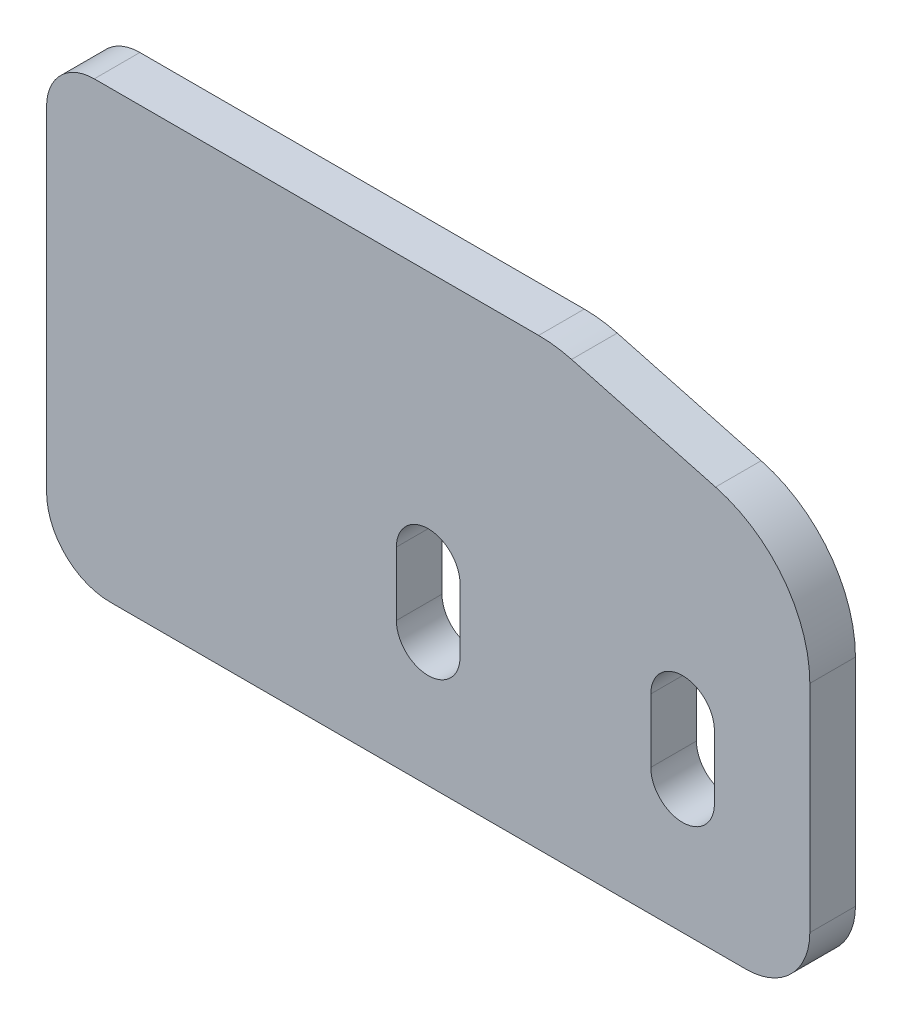
ISO-10303-21;
HEADER;
FILE_DESCRIPTION(('STEP AP214'),'2;1');
FILE_NAME('part.step','',(''),(''),'','','');
FILE_SCHEMA(('AUTOMOTIVE_DESIGN { 1 0 10303 214 1 1 1 1 }'));
ENDSEC;
DATA;
#1=APPLICATION_CONTEXT('core data for automotive mechanical design processes');
#2=APPLICATION_PROTOCOL_DEFINITION('international standard','automotive_design',2000,#1);
#3=PRODUCT_CONTEXT('',#1,'mechanical');
#4=PRODUCT('Part','Part','',(#3));
#5=PRODUCT_RELATED_PRODUCT_CATEGORY('part','',(#4));
#6=PRODUCT_DEFINITION_FORMATION('','',#4);
#7=PRODUCT_DEFINITION_CONTEXT('part definition',#1,'design');
#8=PRODUCT_DEFINITION('design','',#6,#7);
#9=PRODUCT_DEFINITION_SHAPE('','',#8);
#10=(LENGTH_UNIT() NAMED_UNIT(*) SI_UNIT(.MILLI.,.METRE.));
#11=(NAMED_UNIT(*) PLANE_ANGLE_UNIT() SI_UNIT($,.RADIAN.));
#12=(NAMED_UNIT(*) SI_UNIT($,.STERADIAN.) SOLID_ANGLE_UNIT());
#13=UNCERTAINTY_MEASURE_WITH_UNIT(LENGTH_MEASURE(1.E-05),#10,'distance_accuracy_value','');
#14=(GEOMETRIC_REPRESENTATION_CONTEXT(3) GLOBAL_UNCERTAINTY_ASSIGNED_CONTEXT((#13)) GLOBAL_UNIT_ASSIGNED_CONTEXT((#10,
#11,#12)) REPRESENTATION_CONTEXT('',''));
#15=CARTESIAN_POINT('',(0.,0.,0.));
#16=DIRECTION('',(0.,0.,1.));
#17=DIRECTION('',(1.,0.,0.));
#18=AXIS2_PLACEMENT_3D('',#15,#16,#17);
#19=CARTESIAN_POINT('',(-38.1,-22.225,4.55422));
#20=DIRECTION('',(0.,0.,-1.));
#21=DIRECTION('',(-1.,0.,0.));
#22=AXIS2_PLACEMENT_3D('',#19,#20,#21);
#23=PLANE('',#22);
#24=DIRECTION('',(0.,1.,0.));
#25=VECTOR('',#24,1.);
#26=CARTESIAN_POINT('',(28.575,-9.52500000000001,4.55422));
#27=LINE('',#26,#25);
#28=CARTESIAN_POINT('',(28.575,-9.52500000000001,4.55422));
#29=VERTEX_POINT('',#28);
#30=CARTESIAN_POINT('',(28.575,-3.17500000000001,4.55422));
#31=VERTEX_POINT('',#30);
#32=EDGE_CURVE('E206',#29,#31,#27,.T.);
#33=ORIENTED_EDGE('',*,*,#32,.F.);
#34=CARTESIAN_POINT('',(25.4,-9.52500000000001,4.55422));
#35=DIRECTION('',(0.,0.,1.));
#36=DIRECTION('',(1.,0.,0.));
#37=AXIS2_PLACEMENT_3D('',#34,#35,#36);
#38=CIRCLE('',#37,3.175);
#39=CARTESIAN_POINT('',(22.225,-9.52500000000001,4.55422));
#40=VERTEX_POINT('',#39);
#41=EDGE_CURVE('E218',#40,#29,#38,.T.);
#42=ORIENTED_EDGE('',*,*,#41,.F.);
#43=DIRECTION('',(0.,-1.,0.));
#44=VECTOR('',#43,1.);
#45=CARTESIAN_POINT('',(22.225,-9.52500000000001,4.55422));
#46=LINE('',#45,#44);
#47=CARTESIAN_POINT('',(22.225,-3.17500000000001,4.55422));
#48=VERTEX_POINT('',#47);
#49=EDGE_CURVE('E59',#48,#40,#46,.T.);
#50=ORIENTED_EDGE('',*,*,#49,.F.);
#51=CARTESIAN_POINT('',(25.4,-3.17500000000001,4.55422));
#52=DIRECTION('',(0.,0.,1.));
#53=DIRECTION('',(1.,0.,0.));
#54=AXIS2_PLACEMENT_3D('',#51,#52,#53);
#55=CIRCLE('',#54,3.175);
#56=EDGE_CURVE('E198',#31,#48,#55,.T.);
#57=ORIENTED_EDGE('',*,*,#56,.F.);
#58=EDGE_LOOP('',(#33,#42,#50,#57));
#59=FACE_BOUND('',#58,.T.);
#60=DIRECTION('',(1.,0.,0.));
#61=VECTOR('',#60,1.);
#62=CARTESIAN_POINT('',(38.1,-22.225,4.55422));
#63=LINE('',#62,#61);
#64=CARTESIAN_POINT('',(-31.75,-22.225,4.55422));
#65=VERTEX_POINT('',#64);
#66=CARTESIAN_POINT('',(31.75,-22.225,4.55422));
#67=VERTEX_POINT('',#66);
#68=EDGE_CURVE('E240',#65,#67,#63,.T.);
#69=ORIENTED_EDGE('',*,*,#68,.T.);
#70=CARTESIAN_POINT('',(31.75,-15.875,4.55422));
#71=DIRECTION('',(0.,0.,-1.));
#72=DIRECTION('',(-1.,0.,0.));
#73=AXIS2_PLACEMENT_3D('',#70,#71,#72);
#74=CIRCLE('',#73,6.35);
#75=CARTESIAN_POINT('',(38.1,-15.875,4.55422));
#76=VERTEX_POINT('',#75);
#77=EDGE_CURVE('E44',#67,#76,#74,.F.);
#78=ORIENTED_EDGE('',*,*,#77,.T.);
#79=DIRECTION('',(0.,1.,0.));
#80=VECTOR('',#79,1.);
#81=CARTESIAN_POINT('',(38.1,22.225,4.55422));
#82=LINE('',#81,#80);
#83=CARTESIAN_POINT('',(38.1,5.6740377649168,4.55422));
#84=VERTEX_POINT('',#83);
#85=EDGE_CURVE('E244',#76,#84,#82,.T.);
#86=ORIENTED_EDGE('',*,*,#85,.T.);
#87=CARTESIAN_POINT('',(25.4,5.67403776491679,4.55422));
#88=DIRECTION('',(0.,0.,-1.));
#89=DIRECTION('',(-1.,0.,0.));
#90=AXIS2_PLACEMENT_3D('',#87,#88,#89);
#91=CIRCLE('',#90,12.7);
#92=CARTESIAN_POINT('',(28.687001872802,17.941295758788,4.55422));
#93=VERTEX_POINT('',#92);
#94=EDGE_CURVE('E282',#84,#93,#91,.F.);
#95=ORIENTED_EDGE('',*,*,#94,.T.);
#96=DIRECTION('',(0.96592582628907,-0.258819045102515,0.));
#97=VECTOR('',#96,1.);
#98=CARTESIAN_POINT('',(12.7,22.225,4.55422));
#99=LINE('',#98,#97);
#100=CARTESIAN_POINT('',(14.3150151534421,21.7922579938712,4.55422));
#101=VERTEX_POINT('',#100);
#102=EDGE_CURVE('E228',#101,#93,#99,.T.);
#103=ORIENTED_EDGE('',*,*,#102,.F.);
#104=CARTESIAN_POINT('',(11.0280132806401,9.525,4.55422));
#105=DIRECTION('',(0.,0.,-1.));
#106=DIRECTION('',(-1.,0.,0.));
#107=AXIS2_PLACEMENT_3D('',#104,#105,#106);
#108=CIRCLE('',#107,12.7);
#109=CARTESIAN_POINT('',(11.0280132806401,22.225,4.55422));
#110=VERTEX_POINT('',#109);
#111=EDGE_CURVE('E280',#101,#110,#108,.F.);
#112=ORIENTED_EDGE('',*,*,#111,.T.);
#113=DIRECTION('',(-1.,0.,0.));
#114=VECTOR('',#113,1.);
#115=CARTESIAN_POINT('',(38.1,22.225,4.55422));
#116=LINE('',#115,#114);
#117=CARTESIAN_POINT('',(-33.3375,22.225,4.55422));
#118=VERTEX_POINT('',#117);
#119=EDGE_CURVE('E246',#110,#118,#116,.T.);
#120=ORIENTED_EDGE('',*,*,#119,.T.);
#121=CARTESIAN_POINT('',(-33.3375,17.4625,4.55422));
#122=DIRECTION('',(0.,0.,-1.));
#123=DIRECTION('',(-1.,0.,0.));
#124=AXIS2_PLACEMENT_3D('',#121,#122,#123);
#125=CIRCLE('',#124,4.7625);
#126=CARTESIAN_POINT('',(-38.1,17.4625,4.55422));
#127=VERTEX_POINT('',#126);
#128=EDGE_CURVE('E265',#118,#127,#125,.F.);
#129=ORIENTED_EDGE('',*,*,#128,.T.);
#130=DIRECTION('',(0.,-1.,0.));
#131=VECTOR('',#130,1.);
#132=CARTESIAN_POINT('',(-38.1,22.225,4.55422));
#133=LINE('',#132,#131);
#134=CARTESIAN_POINT('',(-38.1,-15.875,4.55422));
#135=VERTEX_POINT('',#134);
#136=EDGE_CURVE('E237',#127,#135,#133,.T.);
#137=ORIENTED_EDGE('',*,*,#136,.T.);
#138=CARTESIAN_POINT('',(-31.75,-15.875,4.55422));
#139=DIRECTION('',(0.,0.,-1.));
#140=DIRECTION('',(-1.,0.,0.));
#141=AXIS2_PLACEMENT_3D('',#138,#139,#140);
#142=CIRCLE('',#141,6.35);
#143=EDGE_CURVE('E299',#135,#65,#142,.F.);
#144=ORIENTED_EDGE('',*,*,#143,.T.);
#145=EDGE_LOOP('',(#69,#78,#86,#95,#103,#112,#120,#129,#137,#144));
#146=FACE_BOUND('',#145,.T.);
#147=DIRECTION('',(0.,1.,0.));
#148=VECTOR('',#147,1.);
#149=CARTESIAN_POINT('',(3.17499999999998,-9.52500000000001,4.55422));
#150=LINE('',#149,#148);
#151=CARTESIAN_POINT('',(3.17500000000002,-9.52500000000001,4.55422));
#152=VERTEX_POINT('',#151);
#153=CARTESIAN_POINT('',(3.17499999999998,-3.17500000000001,4.55422));
#154=VERTEX_POINT('',#153);
#155=EDGE_CURVE('E187',#152,#154,#150,.T.);
#156=ORIENTED_EDGE('',*,*,#155,.F.);
#157=CARTESIAN_POINT('',(0.,-9.52500000000001,4.55422));
#158=DIRECTION('',(0.,0.,1.));
#159=DIRECTION('',(1.,0.,0.));
#160=AXIS2_PLACEMENT_3D('',#157,#158,#159);
#161=CIRCLE('',#160,3.175);
#162=CARTESIAN_POINT('',(-3.17499999999998,-9.52500000000001,4.55422));
#163=VERTEX_POINT('',#162);
#164=EDGE_CURVE('E223',#163,#152,#161,.T.);
#165=ORIENTED_EDGE('',*,*,#164,.F.);
#166=DIRECTION('',(0.,-1.,0.));
#167=VECTOR('',#166,1.);
#168=CARTESIAN_POINT('',(-3.17499999999998,-9.52500000000001,4.55422));
#169=LINE('',#168,#167);
#170=CARTESIAN_POINT('',(-3.17499999999998,-3.17500000000001,4.55422));
#171=VERTEX_POINT('',#170);
#172=EDGE_CURVE('E51',#171,#163,#169,.T.);
#173=ORIENTED_EDGE('',*,*,#172,.F.);
#174=CARTESIAN_POINT('',(0.,-3.17500000000001,4.55422));
#175=DIRECTION('',(0.,0.,1.));
#176=DIRECTION('',(1.,0.,0.));
#177=AXIS2_PLACEMENT_3D('',#174,#175,#176);
#178=CIRCLE('',#177,3.17499999999998);
#179=EDGE_CURVE('E170',#154,#171,#178,.T.);
#180=ORIENTED_EDGE('',*,*,#179,.F.);
#181=EDGE_LOOP('',(#156,#165,#173,#180));
#182=FACE_BOUND('',#181,.T.);
#183=ADVANCED_FACE('F36',(#59,#146,#182),#23,.F.);
#184=CARTESIAN_POINT('',(-38.1,-22.225,0.));
#185=DIRECTION('',(0.,0.,-1.));
#186=DIRECTION('',(-1.,0.,0.));
#187=AXIS2_PLACEMENT_3D('',#184,#185,#186);
#188=PLANE('',#187);
#189=DIRECTION('',(0.,1.,0.));
#190=VECTOR('',#189,1.);
#191=CARTESIAN_POINT('',(38.1,22.225,0.));
#192=LINE('',#191,#190);
#193=CARTESIAN_POINT('',(38.1,-15.875,0.));
#194=VERTEX_POINT('',#193);
#195=CARTESIAN_POINT('',(38.1,5.6740377649168,0.));
#196=VERTEX_POINT('',#195);
#197=EDGE_CURVE('E254',#194,#196,#192,.T.);
#198=ORIENTED_EDGE('',*,*,#197,.F.);
#199=CARTESIAN_POINT('',(31.75,-15.875,0.));
#200=DIRECTION('',(0.,0.,-1.));
#201=DIRECTION('',(-1.,0.,0.));
#202=AXIS2_PLACEMENT_3D('',#199,#200,#201);
#203=CIRCLE('',#202,6.35);
#204=CARTESIAN_POINT('',(31.75,-22.225,0.));
#205=VERTEX_POINT('',#204);
#206=EDGE_CURVE('E292',#194,#205,#203,.T.);
#207=ORIENTED_EDGE('',*,*,#206,.T.);
#208=DIRECTION('',(1.,0.,0.));
#209=VECTOR('',#208,1.);
#210=CARTESIAN_POINT('',(38.1,-22.225,0.));
#211=LINE('',#210,#209);
#212=CARTESIAN_POINT('',(-31.75,-22.225,0.));
#213=VERTEX_POINT('',#212);
#214=EDGE_CURVE('E251',#213,#205,#211,.T.);
#215=ORIENTED_EDGE('',*,*,#214,.F.);
#216=CARTESIAN_POINT('',(-31.75,-15.875,0.));
#217=DIRECTION('',(0.,0.,-1.));
#218=DIRECTION('',(-1.,0.,0.));
#219=AXIS2_PLACEMENT_3D('',#216,#217,#218);
#220=CIRCLE('',#219,6.35);
#221=CARTESIAN_POINT('',(-38.1,-15.875,0.));
#222=VERTEX_POINT('',#221);
#223=EDGE_CURVE('E290',#213,#222,#220,.T.);
#224=ORIENTED_EDGE('',*,*,#223,.T.);
#225=DIRECTION('',(0.,-1.,0.));
#226=VECTOR('',#225,1.);
#227=CARTESIAN_POINT('',(-38.1,22.225,0.));
#228=LINE('',#227,#226);
#229=CARTESIAN_POINT('',(-38.1,17.4625,0.));
#230=VERTEX_POINT('',#229);
#231=EDGE_CURVE('E234',#230,#222,#228,.T.);
#232=ORIENTED_EDGE('',*,*,#231,.F.);
#233=CARTESIAN_POINT('',(-33.3375,17.4625,0.));
#234=DIRECTION('',(0.,0.,-1.));
#235=DIRECTION('',(-1.,0.,0.));
#236=AXIS2_PLACEMENT_3D('',#233,#234,#235);
#237=CIRCLE('',#236,4.7625);
#238=CARTESIAN_POINT('',(-33.3375,22.225,0.));
#239=VERTEX_POINT('',#238);
#240=EDGE_CURVE('E259',#230,#239,#237,.T.);
#241=ORIENTED_EDGE('',*,*,#240,.T.);
#242=DIRECTION('',(-1.,0.,0.));
#243=VECTOR('',#242,1.);
#244=CARTESIAN_POINT('',(38.1,22.225,0.));
#245=LINE('',#244,#243);
#246=CARTESIAN_POINT('',(11.0280132806401,22.225,0.));
#247=VERTEX_POINT('',#246);
#248=EDGE_CURVE('E241',#247,#239,#245,.T.);
#249=ORIENTED_EDGE('',*,*,#248,.F.);
#250=CARTESIAN_POINT('',(11.0280132806401,9.525,0.));
#251=DIRECTION('',(0.,0.,-1.));
#252=DIRECTION('',(-1.,0.,0.));
#253=AXIS2_PLACEMENT_3D('',#250,#251,#252);
#254=CIRCLE('',#253,12.7);
#255=CARTESIAN_POINT('',(14.3150151534421,21.7922579938712,0.));
#256=VERTEX_POINT('',#255);
#257=EDGE_CURVE('E272',#247,#256,#254,.T.);
#258=ORIENTED_EDGE('',*,*,#257,.T.);
#259=DIRECTION('',(0.96592582628907,-0.258819045102515,0.));
#260=VECTOR('',#259,1.);
#261=CARTESIAN_POINT('',(12.7,22.225,0.));
#262=LINE('',#261,#260);
#263=CARTESIAN_POINT('',(28.687001872802,17.941295758788,0.));
#264=VERTEX_POINT('',#263);
#265=EDGE_CURVE('E231',#256,#264,#262,.T.);
#266=ORIENTED_EDGE('',*,*,#265,.T.);
#267=CARTESIAN_POINT('',(25.4,5.67403776491679,0.));
#268=DIRECTION('',(0.,0.,-1.));
#269=DIRECTION('',(-1.,0.,0.));
#270=AXIS2_PLACEMENT_3D('',#267,#268,#269);
#271=CIRCLE('',#270,12.7);
#272=EDGE_CURVE('E274',#264,#196,#271,.T.);
#273=ORIENTED_EDGE('',*,*,#272,.T.);
#274=EDGE_LOOP('',(#198,#207,#215,#224,#232,#241,#249,#258,#266,#273));
#275=FACE_BOUND('',#274,.T.);
#276=CARTESIAN_POINT('',(25.4,-9.52500000000001,0.));
#277=DIRECTION('',(0.,0.,1.));
#278=DIRECTION('',(1.,0.,0.));
#279=AXIS2_PLACEMENT_3D('',#276,#277,#278);
#280=CIRCLE('',#279,3.175);
#281=CARTESIAN_POINT('',(22.225,-9.52500000000001,0.));
#282=VERTEX_POINT('',#281);
#283=CARTESIAN_POINT('',(28.575,-9.52500000000001,0.));
#284=VERTEX_POINT('',#283);
#285=EDGE_CURVE('E220',#282,#284,#280,.T.);
#286=ORIENTED_EDGE('',*,*,#285,.T.);
#287=DIRECTION('',(0.,1.,0.));
#288=VECTOR('',#287,1.);
#289=CARTESIAN_POINT('',(28.575,-22.225,0.));
#290=LINE('',#289,#288);
#291=CARTESIAN_POINT('',(28.575,-3.17500000000001,0.));
#292=VERTEX_POINT('',#291);
#293=EDGE_CURVE('E197',#284,#292,#290,.T.);
#294=ORIENTED_EDGE('',*,*,#293,.T.);
#295=CARTESIAN_POINT('',(25.4,-3.17500000000001,0.));
#296=DIRECTION('',(0.,0.,1.));
#297=DIRECTION('',(1.,0.,0.));
#298=AXIS2_PLACEMENT_3D('',#295,#296,#297);
#299=CIRCLE('',#298,3.175);
#300=CARTESIAN_POINT('',(22.225,-3.17500000000001,0.));
#301=VERTEX_POINT('',#300);
#302=EDGE_CURVE('E199',#292,#301,#299,.T.);
#303=ORIENTED_EDGE('',*,*,#302,.T.);
#304=DIRECTION('',(0.,1.,0.));
#305=VECTOR('',#304,1.);
#306=CARTESIAN_POINT('',(22.225,-22.225,0.));
#307=LINE('',#306,#305);
#308=EDGE_CURVE('E194',#301,#282,#307,.F.);
#309=ORIENTED_EDGE('',*,*,#308,.T.);
#310=EDGE_LOOP('',(#286,#294,#303,#309));
#311=FACE_BOUND('',#310,.T.);
#312=CARTESIAN_POINT('',(0.,-9.52500000000001,0.));
#313=DIRECTION('',(0.,0.,1.));
#314=DIRECTION('',(1.,0.,0.));
#315=AXIS2_PLACEMENT_3D('',#312,#313,#314);
#316=CIRCLE('',#315,3.175);
#317=CARTESIAN_POINT('',(-3.17499999999998,-9.52500000000001,0.));
#318=VERTEX_POINT('',#317);
#319=CARTESIAN_POINT('',(3.17500000000002,-9.52500000000001,0.));
#320=VERTEX_POINT('',#319);
#321=EDGE_CURVE('E226',#318,#320,#316,.T.);
#322=ORIENTED_EDGE('',*,*,#321,.T.);
#323=DIRECTION('',(0.,1.,0.));
#324=VECTOR('',#323,1.);
#325=CARTESIAN_POINT('',(3.17500000000002,-22.225,0.));
#326=LINE('',#325,#324);
#327=CARTESIAN_POINT('',(3.17499999999998,-3.17500000000001,0.));
#328=VERTEX_POINT('',#327);
#329=EDGE_CURVE('E169',#320,#328,#326,.T.);
#330=ORIENTED_EDGE('',*,*,#329,.T.);
#331=CARTESIAN_POINT('',(0.,-3.17500000000001,0.));
#332=DIRECTION('',(0.,0.,1.));
#333=DIRECTION('',(1.,0.,0.));
#334=AXIS2_PLACEMENT_3D('',#331,#332,#333);
#335=CIRCLE('',#334,3.17499999999998);
#336=CARTESIAN_POINT('',(-3.17499999999998,-3.17500000000001,0.));
#337=VERTEX_POINT('',#336);
#338=EDGE_CURVE('E175',#328,#337,#335,.T.);
#339=ORIENTED_EDGE('',*,*,#338,.T.);
#340=DIRECTION('',(0.,1.,0.));
#341=VECTOR('',#340,1.);
#342=CARTESIAN_POINT('',(-3.17499999999998,-22.225,0.));
#343=LINE('',#342,#341);
#344=EDGE_CURVE('E160',#337,#318,#343,.F.);
#345=ORIENTED_EDGE('',*,*,#344,.T.);
#346=EDGE_LOOP('',(#322,#330,#339,#345));
#347=FACE_BOUND('',#346,.T.);
#348=ADVANCED_FACE('F181',(#275,#311,#347),#188,.T.);
#349=CARTESIAN_POINT('',(38.1,22.225,4.55422));
#350=DIRECTION('',(-1.,0.,0.));
#351=DIRECTION('',(0.,-1.,0.));
#352=AXIS2_PLACEMENT_3D('',#349,#350,#351);
#353=PLANE('',#352);
#354=ORIENTED_EDGE('',*,*,#85,.F.);
#355=DIRECTION('',(0.,0.,-1.));
#356=VECTOR('',#355,1.);
#357=CARTESIAN_POINT('',(38.1,-15.875,4.55422));
#358=LINE('',#357,#356);
#359=EDGE_CURVE('E287',#76,#194,#358,.T.);
#360=ORIENTED_EDGE('',*,*,#359,.T.);
#361=ORIENTED_EDGE('',*,*,#197,.T.);
#362=DIRECTION('',(0.,0.,-1.));
#363=VECTOR('',#362,1.);
#364=CARTESIAN_POINT('',(38.1,5.6740377649168,4.55422));
#365=LINE('',#364,#363);
#366=EDGE_CURVE('E277',#196,#84,#365,.F.);
#367=ORIENTED_EDGE('',*,*,#366,.T.);
#368=EDGE_LOOP('',(#354,#360,#361,#367));
#369=FACE_BOUND('',#368,.T.);
#370=ADVANCED_FACE('F309',(#369),#353,.F.);
#371=CARTESIAN_POINT('',(38.1,22.225,4.55422));
#372=DIRECTION('',(0.,-1.,0.));
#373=DIRECTION('',(1.,0.,0.));
#374=AXIS2_PLACEMENT_3D('',#371,#372,#373);
#375=PLANE('',#374);
#376=ORIENTED_EDGE('',*,*,#119,.F.);
#377=DIRECTION('',(0.,0.,-1.));
#378=VECTOR('',#377,1.);
#379=CARTESIAN_POINT('',(11.0280132806401,22.225,0.));
#380=LINE('',#379,#378);
#381=EDGE_CURVE('E284',#110,#247,#380,.T.);
#382=ORIENTED_EDGE('',*,*,#381,.T.);
#383=ORIENTED_EDGE('',*,*,#248,.T.);
#384=DIRECTION('',(0.,0.,-1.));
#385=VECTOR('',#384,1.);
#386=CARTESIAN_POINT('',(-33.3375,22.225,4.55422));
#387=LINE('',#386,#385);
#388=EDGE_CURVE('E262',#239,#118,#387,.F.);
#389=ORIENTED_EDGE('',*,*,#388,.T.);
#390=EDGE_LOOP('',(#376,#382,#383,#389));
#391=FACE_BOUND('',#390,.T.);
#392=ADVANCED_FACE('F336',(#391),#375,.F.);
#393=CARTESIAN_POINT('',(-38.1,22.225,4.55422));
#394=DIRECTION('',(1.,0.,0.));
#395=DIRECTION('',(0.,1.,0.));
#396=AXIS2_PLACEMENT_3D('',#393,#394,#395);
#397=PLANE('',#396);
#398=ORIENTED_EDGE('',*,*,#231,.T.);
#399=DIRECTION('',(0.,0.,-1.));
#400=VECTOR('',#399,1.);
#401=CARTESIAN_POINT('',(-38.1,-15.875,4.55422));
#402=LINE('',#401,#400);
#403=EDGE_CURVE('E11',#222,#135,#402,.F.);
#404=ORIENTED_EDGE('',*,*,#403,.T.);
#405=ORIENTED_EDGE('',*,*,#136,.F.);
#406=DIRECTION('',(0.,0.,-1.));
#407=VECTOR('',#406,1.);
#408=CARTESIAN_POINT('',(-38.1,17.4625,4.55422));
#409=LINE('',#408,#407);
#410=EDGE_CURVE('E248',#127,#230,#409,.T.);
#411=ORIENTED_EDGE('',*,*,#410,.T.);
#412=EDGE_LOOP('',(#398,#404,#405,#411));
#413=FACE_BOUND('',#412,.T.);
#414=ADVANCED_FACE('F325',(#413),#397,.F.);
#415=CARTESIAN_POINT('',(38.1,-22.225,4.55422));
#416=DIRECTION('',(0.,1.,0.));
#417=DIRECTION('',(-1.,0.,0.));
#418=AXIS2_PLACEMENT_3D('',#415,#416,#417);
#419=PLANE('',#418);
#420=ORIENTED_EDGE('',*,*,#214,.T.);
#421=DIRECTION('',(0.,0.,-1.));
#422=VECTOR('',#421,1.);
#423=CARTESIAN_POINT('',(31.75,-22.225,4.55422));
#424=LINE('',#423,#422);
#425=EDGE_CURVE('E297',#205,#67,#424,.F.);
#426=ORIENTED_EDGE('',*,*,#425,.T.);
#427=ORIENTED_EDGE('',*,*,#68,.F.);
#428=DIRECTION('',(0.,0.,-1.));
#429=VECTOR('',#428,1.);
#430=CARTESIAN_POINT('',(-31.75,-22.225,4.55422));
#431=LINE('',#430,#429);
#432=EDGE_CURVE('E294',#65,#213,#431,.T.);
#433=ORIENTED_EDGE('',*,*,#432,.T.);
#434=EDGE_LOOP('',(#420,#426,#427,#433));
#435=FACE_BOUND('',#434,.T.);
#436=ADVANCED_FACE('F318',(#435),#419,.F.);
#437=CARTESIAN_POINT('',(12.7,22.225,4.55422));
#438=DIRECTION('',(0.258819045102515,0.96592582628907,0.));
#439=DIRECTION('',(0.96592582628907,-0.258819045102515,0.));
#440=AXIS2_PLACEMENT_3D('',#437,#438,#439);
#441=PLANE('',#440);
#442=ORIENTED_EDGE('',*,*,#102,.T.);
#443=DIRECTION('',(0.,0.,-1.));
#444=VECTOR('',#443,1.);
#445=CARTESIAN_POINT('',(28.687001872802,17.941295758788,0.));
#446=LINE('',#445,#444);
#447=EDGE_CURVE('E269',#93,#264,#446,.T.);
#448=ORIENTED_EDGE('',*,*,#447,.T.);
#449=ORIENTED_EDGE('',*,*,#265,.F.);
#450=DIRECTION('',(0.,0.,-1.));
#451=VECTOR('',#450,1.);
#452=CARTESIAN_POINT('',(14.3150151534421,21.7922579938712,4.55422));
#453=LINE('',#452,#451);
#454=EDGE_CURVE('E267',#256,#101,#453,.F.);
#455=ORIENTED_EDGE('',*,*,#454,.T.);
#456=EDGE_LOOP('',(#442,#448,#449,#455));
#457=FACE_BOUND('',#456,.T.);
#458=ADVANCED_FACE('F344',(#457),#441,.T.);
#459=CARTESIAN_POINT('',(-33.3375,17.4625,4.55422));
#460=DIRECTION('',(0.,0.,-1.));
#461=DIRECTION('',(-1.,0.,0.));
#462=AXIS2_PLACEMENT_3D('',#459,#460,#461);
#463=CYLINDRICAL_SURFACE('',#462,4.7625);
#464=ORIENTED_EDGE('',*,*,#128,.F.);
#465=ORIENTED_EDGE('',*,*,#388,.F.);
#466=ORIENTED_EDGE('',*,*,#240,.F.);
#467=ORIENTED_EDGE('',*,*,#410,.F.);
#468=EDGE_LOOP('',(#464,#465,#466,#467));
#469=FACE_BOUND('',#468,.T.);
#470=ADVANCED_FACE('F330',(#469),#463,.T.);
#471=CARTESIAN_POINT('',(25.4,5.67403776491679,4.55422));
#472=DIRECTION('',(0.,0.,1.));
#473=DIRECTION('',(1.,0.,0.));
#474=AXIS2_PLACEMENT_3D('',#471,#472,#473);
#475=CYLINDRICAL_SURFACE('',#474,12.7);
#476=ORIENTED_EDGE('',*,*,#94,.F.);
#477=ORIENTED_EDGE('',*,*,#366,.F.);
#478=ORIENTED_EDGE('',*,*,#272,.F.);
#479=ORIENTED_EDGE('',*,*,#447,.F.);
#480=EDGE_LOOP('',(#476,#477,#478,#479));
#481=FACE_BOUND('',#480,.T.);
#482=ADVANCED_FACE('F347',(#481),#475,.T.);
#483=CARTESIAN_POINT('',(11.0280132806401,9.525,4.55422));
#484=DIRECTION('',(0.,0.,1.));
#485=DIRECTION('',(1.,0.,0.));
#486=AXIS2_PLACEMENT_3D('',#483,#484,#485);
#487=CYLINDRICAL_SURFACE('',#486,12.7);
#488=ORIENTED_EDGE('',*,*,#111,.F.);
#489=ORIENTED_EDGE('',*,*,#454,.F.);
#490=ORIENTED_EDGE('',*,*,#257,.F.);
#491=ORIENTED_EDGE('',*,*,#381,.F.);
#492=EDGE_LOOP('',(#488,#489,#490,#491));
#493=FACE_BOUND('',#492,.T.);
#494=ADVANCED_FACE('F340',(#493),#487,.T.);
#495=CARTESIAN_POINT('',(0.,-9.52500000000001,0.));
#496=DIRECTION('',(0.,0.,1.));
#497=DIRECTION('',(1.,0.,0.));
#498=AXIS2_PLACEMENT_3D('',#495,#496,#497);
#499=CYLINDRICAL_SURFACE('',#498,3.175);
#500=ORIENTED_EDGE('',*,*,#164,.T.);
#501=DIRECTION('',(0.,0.,1.));
#502=VECTOR('',#501,1.);
#503=CARTESIAN_POINT('',(3.17500000000002,-9.52500000000001,4.55422));
#504=LINE('',#503,#502);
#505=EDGE_CURVE('E191',#152,#320,#504,.F.);
#506=ORIENTED_EDGE('',*,*,#505,.T.);
#507=ORIENTED_EDGE('',*,*,#321,.F.);
#508=DIRECTION('',(0.,0.,1.));
#509=VECTOR('',#508,1.);
#510=CARTESIAN_POINT('',(-3.17499999999998,-9.52500000000001,4.55422));
#511=LINE('',#510,#509);
#512=EDGE_CURVE('E164',#163,#318,#511,.F.);
#513=ORIENTED_EDGE('',*,*,#512,.F.);
#514=EDGE_LOOP('',(#500,#506,#507,#513));
#515=FACE_BOUND('',#514,.T.);
#516=ADVANCED_FACE('F354',(#515),#499,.F.);
#517=CARTESIAN_POINT('',(25.4,-9.52500000000001,0.));
#518=DIRECTION('',(0.,0.,1.));
#519=DIRECTION('',(1.,0.,0.));
#520=AXIS2_PLACEMENT_3D('',#517,#518,#519);
#521=CYLINDRICAL_SURFACE('',#520,3.175);
#522=ORIENTED_EDGE('',*,*,#41,.T.);
#523=DIRECTION('',(0.,0.,1.));
#524=VECTOR('',#523,1.);
#525=CARTESIAN_POINT('',(28.575,-9.52500000000001,4.55422));
#526=LINE('',#525,#524);
#527=EDGE_CURVE('E215',#29,#284,#526,.F.);
#528=ORIENTED_EDGE('',*,*,#527,.T.);
#529=ORIENTED_EDGE('',*,*,#285,.F.);
#530=DIRECTION('',(0.,0.,1.));
#531=VECTOR('',#530,1.);
#532=CARTESIAN_POINT('',(22.225,-9.52500000000001,4.55422));
#533=LINE('',#532,#531);
#534=EDGE_CURVE('E202',#40,#282,#533,.F.);
#535=ORIENTED_EDGE('',*,*,#534,.F.);
#536=EDGE_LOOP('',(#522,#528,#529,#535));
#537=FACE_BOUND('',#536,.T.);
#538=ADVANCED_FACE('F424',(#537),#521,.F.);
#539=CARTESIAN_POINT('',(31.75,-15.875,4.55422));
#540=DIRECTION('',(0.,0.,-1.));
#541=DIRECTION('',(-1.,0.,0.));
#542=AXIS2_PLACEMENT_3D('',#539,#540,#541);
#543=CYLINDRICAL_SURFACE('',#542,6.35);
#544=ORIENTED_EDGE('',*,*,#77,.F.);
#545=ORIENTED_EDGE('',*,*,#425,.F.);
#546=ORIENTED_EDGE('',*,*,#206,.F.);
#547=ORIENTED_EDGE('',*,*,#359,.F.);
#548=EDGE_LOOP('',(#544,#545,#546,#547));
#549=FACE_BOUND('',#548,.T.);
#550=ADVANCED_FACE('F313',(#549),#543,.T.);
#551=CARTESIAN_POINT('',(-31.75,-15.875,4.55422));
#552=DIRECTION('',(0.,0.,-1.));
#553=DIRECTION('',(-1.,0.,0.));
#554=AXIS2_PLACEMENT_3D('',#551,#552,#553);
#555=CYLINDRICAL_SURFACE('',#554,6.35);
#556=ORIENTED_EDGE('',*,*,#143,.F.);
#557=ORIENTED_EDGE('',*,*,#403,.F.);
#558=ORIENTED_EDGE('',*,*,#223,.F.);
#559=ORIENTED_EDGE('',*,*,#432,.F.);
#560=EDGE_LOOP('',(#556,#557,#558,#559));
#561=FACE_BOUND('',#560,.T.);
#562=ADVANCED_FACE('F38',(#561),#555,.T.);
#563=CARTESIAN_POINT('',(28.575,-9.52500000000001,4.55422));
#564=DIRECTION('',(-1.,0.,0.));
#565=DIRECTION('',(0.,1.,0.));
#566=AXIS2_PLACEMENT_3D('',#563,#564,#565);
#567=PLANE('',#566);
#568=ORIENTED_EDGE('',*,*,#527,.F.);
#569=ORIENTED_EDGE('',*,*,#32,.T.);
#570=DIRECTION('',(0.,0.,1.));
#571=VECTOR('',#570,1.);
#572=CARTESIAN_POINT('',(28.575,-3.17500000000001,4.55422));
#573=LINE('',#572,#571);
#574=EDGE_CURVE('E212',#31,#292,#573,.F.);
#575=ORIENTED_EDGE('',*,*,#574,.T.);
#576=ORIENTED_EDGE('',*,*,#293,.F.);
#577=EDGE_LOOP('',(#568,#569,#575,#576));
#578=FACE_BOUND('',#577,.T.);
#579=ADVANCED_FACE('F456',(#578),#567,.T.);
#580=CARTESIAN_POINT('',(25.4,-3.17500000000001,4.55422));
#581=DIRECTION('',(0.,0.,1.));
#582=DIRECTION('',(1.,0.,0.));
#583=AXIS2_PLACEMENT_3D('',#580,#581,#582);
#584=CYLINDRICAL_SURFACE('',#583,3.175);
#585=ORIENTED_EDGE('',*,*,#574,.F.);
#586=ORIENTED_EDGE('',*,*,#56,.T.);
#587=DIRECTION('',(0.,0.,1.));
#588=VECTOR('',#587,1.);
#589=CARTESIAN_POINT('',(22.225,-3.17500000000001,4.55422));
#590=LINE('',#589,#588);
#591=EDGE_CURVE('E209',#48,#301,#590,.F.);
#592=ORIENTED_EDGE('',*,*,#591,.T.);
#593=ORIENTED_EDGE('',*,*,#302,.F.);
#594=EDGE_LOOP('',(#585,#586,#592,#593));
#595=FACE_BOUND('',#594,.T.);
#596=ADVANCED_FACE('F460',(#595),#584,.F.);
#597=CARTESIAN_POINT('',(22.225,-9.52500000000001,4.55422));
#598=DIRECTION('',(1.,0.,0.));
#599=DIRECTION('',(0.,-1.,0.));
#600=AXIS2_PLACEMENT_3D('',#597,#598,#599);
#601=PLANE('',#600);
#602=ORIENTED_EDGE('',*,*,#591,.F.);
#603=ORIENTED_EDGE('',*,*,#49,.T.);
#604=ORIENTED_EDGE('',*,*,#534,.T.);
#605=ORIENTED_EDGE('',*,*,#308,.F.);
#606=EDGE_LOOP('',(#602,#603,#604,#605));
#607=FACE_BOUND('',#606,.T.);
#608=ADVANCED_FACE('F470',(#607),#601,.T.);
#609=CARTESIAN_POINT('',(3.17499999999998,-9.52500000000001,4.55422));
#610=DIRECTION('',(-1.,0.,0.));
#611=DIRECTION('',(0.,1.,0.));
#612=AXIS2_PLACEMENT_3D('',#609,#610,#611);
#613=PLANE('',#612);
#614=ORIENTED_EDGE('',*,*,#505,.F.);
#615=ORIENTED_EDGE('',*,*,#155,.T.);
#616=DIRECTION('',(0.,0.,1.));
#617=VECTOR('',#616,1.);
#618=CARTESIAN_POINT('',(3.17499999999998,-3.17500000000001,4.55422));
#619=LINE('',#618,#617);
#620=EDGE_CURVE('E178',#154,#328,#619,.F.);
#621=ORIENTED_EDGE('',*,*,#620,.T.);
#622=ORIENTED_EDGE('',*,*,#329,.F.);
#623=EDGE_LOOP('',(#614,#615,#621,#622));
#624=FACE_BOUND('',#623,.T.);
#625=ADVANCED_FACE('F480',(#624),#613,.T.);
#626=CARTESIAN_POINT('',(0.,-3.17500000000001,4.55422));
#627=DIRECTION('',(0.,0.,1.));
#628=DIRECTION('',(1.,0.,0.));
#629=AXIS2_PLACEMENT_3D('',#626,#627,#628);
#630=CYLINDRICAL_SURFACE('',#629,3.17499999999998);
#631=ORIENTED_EDGE('',*,*,#620,.F.);
#632=ORIENTED_EDGE('',*,*,#179,.T.);
#633=DIRECTION('',(0.,0.,1.));
#634=VECTOR('',#633,1.);
#635=CARTESIAN_POINT('',(-3.17499999999998,-3.17500000000001,4.55422));
#636=LINE('',#635,#634);
#637=EDGE_CURVE('E163',#171,#337,#636,.F.);
#638=ORIENTED_EDGE('',*,*,#637,.T.);
#639=ORIENTED_EDGE('',*,*,#338,.F.);
#640=EDGE_LOOP('',(#631,#632,#638,#639));
#641=FACE_BOUND('',#640,.T.);
#642=ADVANCED_FACE('F174',(#641),#630,.F.);
#643=CARTESIAN_POINT('',(-3.17499999999998,-9.52500000000001,4.55422));
#644=DIRECTION('',(1.,0.,0.));
#645=DIRECTION('',(0.,-1.,0.));
#646=AXIS2_PLACEMENT_3D('',#643,#644,#645);
#647=PLANE('',#646);
#648=ORIENTED_EDGE('',*,*,#637,.F.);
#649=ORIENTED_EDGE('',*,*,#172,.T.);
#650=ORIENTED_EDGE('',*,*,#512,.T.);
#651=ORIENTED_EDGE('',*,*,#344,.F.);
#652=EDGE_LOOP('',(#648,#649,#650,#651));
#653=FACE_BOUND('',#652,.T.);
#654=ADVANCED_FACE('F162',(#653),#647,.T.);
#655=CLOSED_SHELL('',(#183,#348,#370,#392,#414,#436,#458,#470,#482,#494,#516,#538,#550,#562,
#579,#596,#608,#625,#642,#654));
#656=MANIFOLD_SOLID_BREP('B2',#655);
#657=ADVANCED_BREP_SHAPE_REPRESENTATION('',(#18,#656),#14);
#658=SHAPE_DEFINITION_REPRESENTATION(#9,#657);
ENDSEC;
END-ISO-10303-21;
